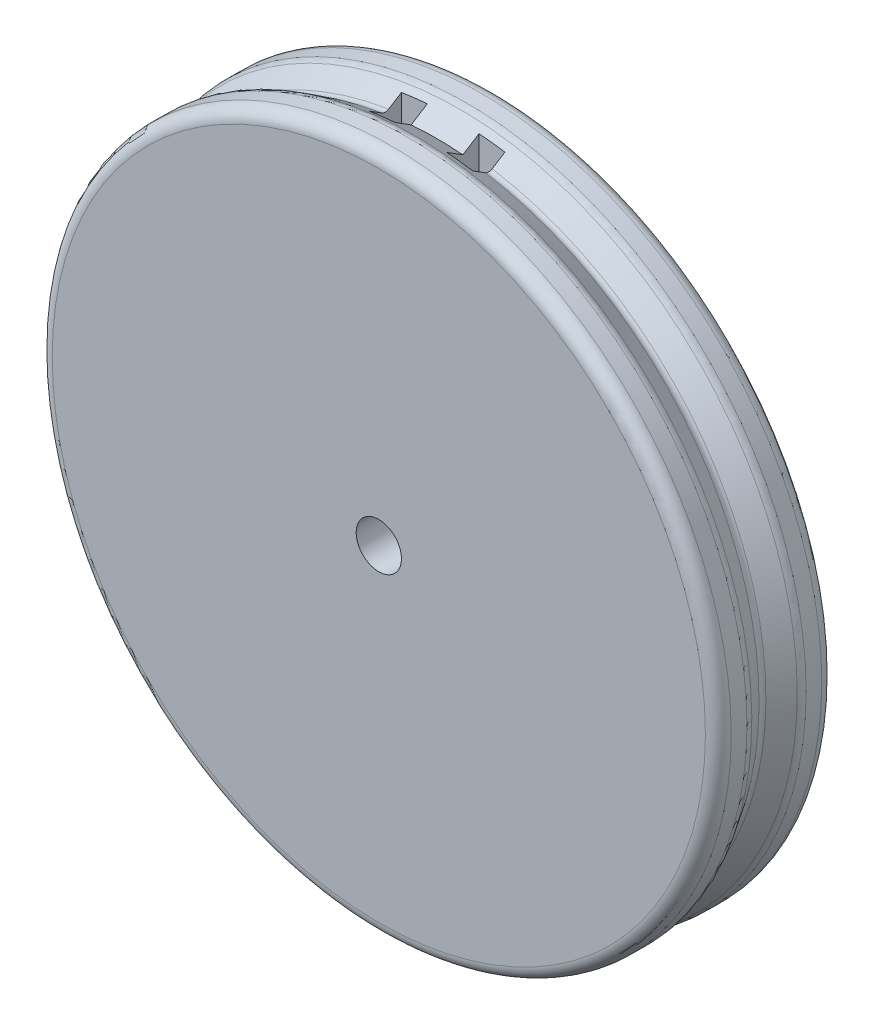
ISO-10303-21;
HEADER;
FILE_DESCRIPTION(('STEP AP214'),'2;1');
FILE_NAME('part.step','',(''),(''),'','','');
FILE_SCHEMA(('AUTOMOTIVE_DESIGN { 1 0 10303 214 1 1 1 1 }'));
ENDSEC;
DATA;
#1=APPLICATION_CONTEXT('core data for automotive mechanical design processes');
#2=APPLICATION_PROTOCOL_DEFINITION('international standard','automotive_design',2000,#1);
#3=PRODUCT_CONTEXT('',#1,'mechanical');
#4=PRODUCT('Part','Part','',(#3));
#5=PRODUCT_RELATED_PRODUCT_CATEGORY('part','',(#4));
#6=PRODUCT_DEFINITION_FORMATION('','',#4);
#7=PRODUCT_DEFINITION_CONTEXT('part definition',#1,'design');
#8=PRODUCT_DEFINITION('design','',#6,#7);
#9=PRODUCT_DEFINITION_SHAPE('','',#8);
#10=(LENGTH_UNIT() NAMED_UNIT(*) SI_UNIT(.MILLI.,.METRE.));
#11=(NAMED_UNIT(*) PLANE_ANGLE_UNIT() SI_UNIT($,.RADIAN.));
#12=(NAMED_UNIT(*) SI_UNIT($,.STERADIAN.) SOLID_ANGLE_UNIT());
#13=UNCERTAINTY_MEASURE_WITH_UNIT(LENGTH_MEASURE(1.E-05),#10,'distance_accuracy_value','');
#14=(GEOMETRIC_REPRESENTATION_CONTEXT(3) GLOBAL_UNCERTAINTY_ASSIGNED_CONTEXT((#13)) GLOBAL_UNIT_ASSIGNED_CONTEXT((#10,
#11,#12)) REPRESENTATION_CONTEXT('',''));
#15=CARTESIAN_POINT('',(0.,0.,0.));
#16=DIRECTION('',(0.,0.,1.));
#17=DIRECTION('',(1.,0.,0.));
#18=AXIS2_PLACEMENT_3D('',#15,#16,#17);
#19=CARTESIAN_POINT('',(0.,0.,0.));
#20=DIRECTION('',(0.,0.,1.));
#21=DIRECTION('',(1.,0.,0.));
#22=AXIS2_PLACEMENT_3D('',#19,#20,#21);
#23=CONICAL_SURFACE('',#22,50.,0.558599315343562);
#24=CARTESIAN_POINT('',(0.,0.,3.51359457281628));
#25=DIRECTION('',(0.,0.,-1.));
#26=DIRECTION('',(-1.,0.,0.));
#27=AXIS2_PLACEMENT_3D('',#24,#25,#26);
#28=CIRCLE('',#27,52.1959966080102);
#29=CARTESIAN_POINT('',(-52.1959966080102,0.,3.51359457281628));
#30=VERTEX_POINT('',#29);
#31=EDGE_CURVE('E11',#30,#30,#28,.T.);
#32=ORIENTED_EDGE('',*,*,#31,.T.);
#33=EDGE_LOOP('',(#32));
#34=FACE_BOUND('',#33,.T.);
#35=CARTESIAN_POINT('',(-8.,60.1595952411245,17.1026923566715));
#36=CARTESIAN_POINT('',(-8.,58.491642326766,14.4573399795328));
#37=CARTESIAN_POINT('',(-8.,56.822899257308,11.8124851117805));
#38=CARTESIAN_POINT('',(-8.,53.4831627116018,6.52420182006173));
#39=CARTESIAN_POINT('',(-8.,51.8121692384593,3.88077339413381));
#40=CARTESIAN_POINT('',(-8.,48.4672559644862,-1.40423482709844));
#41=CARTESIAN_POINT('',(-8.,46.7933361615057,-4.04581462104272));
#42=CARTESIAN_POINT('',(-8.,44.2794379450728,-8.00627094005387));
#43=CARTESIAN_POINT('',(-8.,43.4409682079165,-9.32610506125495));
#44=CARTESIAN_POINT('',(-8.,41.7628219409935,-11.9650062881157));
#45=CARTESIAN_POINT('',(-8.,40.9231454109283,-13.2840733935856));
#46=CARTESIAN_POINT('',(-8.,40.0827651894536,-14.6026923566715));
#47=B_SPLINE_CURVE_WITH_KNOTS('',3,(#35,#36,#37,#38,#39,#40,#41,#42,#43,#44,#45,#46),
.UNSPECIFIED.,.F.,.F.,(4,2,2,2,2,4),(0.,9.3818771268979,18.7637413199553,28.1456124080422,
32.8365544267009,37.5274976061084),.UNSPECIFIED.);
#48=CARTESIAN_POINT('',(-8.,50.938113493238,2.5));
#49=VERTEX_POINT('',#48);
#50=CARTESIAN_POINT('',(-8.,49.691394223485,0.529998940003178));
#51=VERTEX_POINT('',#50);
#52=EDGE_CURVE('E209',#49,#51,#47,.T.);
#53=ORIENTED_EDGE('',*,*,#52,.T.);
#54=CARTESIAN_POINT('',(0.,0.,0.529998940003176));
#55=DIRECTION('',(0.,0.,1.));
#56=DIRECTION('',(1.,0.,0.));
#57=AXIS2_PLACEMENT_3D('',#54,#55,#56);
#58=CIRCLE('',#57,50.331249337502);
#59=CARTESIAN_POINT('',(8.,49.691394223485,0.529998940003174));
#60=VERTEX_POINT('',#59);
#61=EDGE_CURVE('E312',#51,#60,#58,.T.);
#62=ORIENTED_EDGE('',*,*,#61,.T.);
#63=CARTESIAN_POINT('',(8.,40.0827651894536,-14.6026923566715));
#64=CARTESIAN_POINT('',(8.,40.9231454109283,-13.2840733935856));
#65=CARTESIAN_POINT('',(8.,41.7628219409935,-11.9650062881158));
#66=CARTESIAN_POINT('',(8.,43.4409682079165,-9.32610506125496));
#67=CARTESIAN_POINT('',(8.,44.2794379450728,-8.00627094005388));
#68=CARTESIAN_POINT('',(8.,46.7933361615057,-4.04581462104273));
#69=CARTESIAN_POINT('',(8.,48.4672559644862,-1.40423482709844));
#70=CARTESIAN_POINT('',(8.,51.8121692384593,3.88077339413381));
#71=CARTESIAN_POINT('',(8.,53.4831627116018,6.52420182006173));
#72=CARTESIAN_POINT('',(8.,56.822899257308,11.8124851117805));
#73=CARTESIAN_POINT('',(8.,58.491642326766,14.4573399795328));
#74=CARTESIAN_POINT('',(8.,60.1595952411245,17.1026923566715));
#75=B_SPLINE_CURVE_WITH_KNOTS('',3,(#63,#64,#65,#66,#67,#68,#69,#70,#71,#72,#73,#74),
.UNSPECIFIED.,.F.,.F.,(4,2,2,2,2,4),(0.,4.69094317940753,9.38188519806622,18.7637562861532,
28.1456204792105,37.5274976061084),.UNSPECIFIED.);
#76=CARTESIAN_POINT('',(8.,50.938113493238,2.5));
#77=VERTEX_POINT('',#76);
#78=EDGE_CURVE('E279',#60,#77,#75,.T.);
#79=ORIENTED_EDGE('',*,*,#78,.T.);
#80=CARTESIAN_POINT('',(0.,0.,2.5));
#81=DIRECTION('',(0.,0.,1.));
#82=DIRECTION('',(1.,0.,0.));
#83=AXIS2_PLACEMENT_3D('',#80,#81,#82);
#84=CIRCLE('',#83,51.5625);
#85=CARTESIAN_POINT('',(4.,51.4071143544354,2.5));
#86=VERTEX_POINT('',#85);
#87=EDGE_CURVE('E378',#77,#86,#84,.T.);
#88=ORIENTED_EDGE('',*,*,#87,.T.);
#89=CARTESIAN_POINT('',(4.,60.8415281505054,17.5566008124678));
#90=CARTESIAN_POINT('',(4.,59.1387265663707,14.8380054496506));
#91=CARTESIAN_POINT('',(4.,57.4357202998213,12.1195382530214));
#92=CARTESIAN_POINT('',(4.,54.0291283739475,6.68296724970331));
#93=CARTESIAN_POINT('',(4.,52.3255427146736,3.96486344298277));
#94=CARTESIAN_POINT('',(4.,48.9176215973735,-1.47087432650707));
#95=CARTESIAN_POINT('',(4.,47.2132861393114,-4.18850828925401));
#96=CARTESIAN_POINT('',(4.,43.8035476254644,-9.62310669636246));
#97=CARTESIAN_POINT('',(4.,42.0981445695848,-12.3400711406646));
#98=CARTESIAN_POINT('',(4.,40.3920489257282,-15.0566008124678));
#99=B_SPLINE_CURVE_WITH_KNOTS('',3,(#89,#90,#91,#92,#93,#94,#95,#96,#97,#98),.UNSPECIFIED.,.F.,
.F.,(4,2,2,2,4),(0.,9.62354646001774,19.247092080848,28.87063815981,38.4941850912957),.UNSPECIFIED.);
#100=CARTESIAN_POINT('',(4.,49.8397431775085,0.));
#101=VERTEX_POINT('',#100);
#102=EDGE_CURVE('E286',#86,#101,#99,.T.);
#103=ORIENTED_EDGE('',*,*,#102,.T.);
#104=CARTESIAN_POINT('',(0.,0.,0.));
#105=DIRECTION('',(0.,0.,1.));
#106=DIRECTION('',(1.,0.,0.));
#107=AXIS2_PLACEMENT_3D('',#104,#105,#106);
#108=CIRCLE('',#107,50.);
#109=CARTESIAN_POINT('',(-4.,49.8397431775085,0.));
#110=VERTEX_POINT('',#109);
#111=EDGE_CURVE('E293',#101,#110,#108,.T.);
#112=ORIENTED_EDGE('',*,*,#111,.T.);
#113=CARTESIAN_POINT('',(-4.,40.3920489257282,-15.0566008124678));
#114=CARTESIAN_POINT('',(-4.,42.0981445695848,-12.3400711406646));
#115=CARTESIAN_POINT('',(-4.,43.8035476254644,-9.62310669636246));
#116=CARTESIAN_POINT('',(-4.,47.2132861393115,-4.18850828925401));
#117=CARTESIAN_POINT('',(-4.,48.9176215973735,-1.47087432650707));
#118=CARTESIAN_POINT('',(-4.,52.3255427146736,3.96486344298278));
#119=CARTESIAN_POINT('',(-4.,54.0291283739475,6.68296724970331));
#120=CARTESIAN_POINT('',(-4.,57.4357202998213,12.1195382530214));
#121=CARTESIAN_POINT('',(-4.,59.1387265663707,14.8380054496506));
#122=CARTESIAN_POINT('',(-4.,60.8415281505054,17.5566008124678));
#123=B_SPLINE_CURVE_WITH_KNOTS('',3,(#113,#114,#115,#116,#117,#118,#119,#120,#121,#122),
.UNSPECIFIED.,.F.,.F.,(4,2,2,2,4),(0.,9.62354693148574,19.2470930104477,28.870638631278,
38.4941850912957),.UNSPECIFIED.);
#124=CARTESIAN_POINT('',(-4.,51.4071143544354,2.5));
#125=VERTEX_POINT('',#124);
#126=EDGE_CURVE('E193',#110,#125,#123,.T.);
#127=ORIENTED_EDGE('',*,*,#126,.T.);
#128=EDGE_CURVE('E363',#125,#49,#84,.T.);
#129=ORIENTED_EDGE('',*,*,#128,.T.);
#130=EDGE_LOOP('',(#53,#62,#79,#88,#103,#112,#127,#129));
#131=FACE_BOUND('',#130,.T.);
#132=ADVANCED_FACE('F39',(#34,#131),#23,.T.);
#133=CARTESIAN_POINT('',(0.,0.,9.));
#134=DIRECTION('',(0.,0.,1.));
#135=DIRECTION('',(1.,0.,0.));
#136=AXIS2_PLACEMENT_3D('',#133,#134,#135);
#137=PLANE('',#136);
#138=CARTESIAN_POINT('',(0.,0.,9.));
#139=DIRECTION('',(0.,0.,1.));
#140=DIRECTION('',(1.,0.,0.));
#141=AXIS2_PLACEMENT_3D('',#138,#139,#140);
#142=CIRCLE('',#141,50.5);
#143=CARTESIAN_POINT('',(50.5,0.,9.));
#144=VERTEX_POINT('',#143);
#145=EDGE_CURVE('E314',#144,#144,#142,.T.);
#146=ORIENTED_EDGE('',*,*,#145,.T.);
#147=EDGE_LOOP('',(#146));
#148=FACE_BOUND('',#147,.T.);
#149=CARTESIAN_POINT('',(0.,0.,9.));
#150=DIRECTION('',(0.,0.,-1.));
#151=DIRECTION('',(-1.,0.,0.));
#152=AXIS2_PLACEMENT_3D('',#149,#150,#151);
#153=CIRCLE('',#152,3.5);
#154=CARTESIAN_POINT('',(-3.5,0.,9.));
#155=VERTEX_POINT('',#154);
#156=EDGE_CURVE('E177',#155,#155,#153,.T.);
#157=ORIENTED_EDGE('',*,*,#156,.T.);
#158=EDGE_LOOP('',(#157));
#159=FACE_BOUND('',#158,.T.);
#160=ADVANCED_FACE('F355',(#148,#159),#137,.T.);
#161=CARTESIAN_POINT('',(0.,0.,9.));
#162=DIRECTION('',(0.,0.,-1.));
#163=DIRECTION('',(-1.,0.,0.));
#164=AXIS2_PLACEMENT_3D('',#161,#162,#163);
#165=CYLINDRICAL_SURFACE('',#164,52.5);
#166=CARTESIAN_POINT('',(0.,0.,7.));
#167=DIRECTION('',(0.,0.,1.));
#168=DIRECTION('',(1.,0.,0.));
#169=AXIS2_PLACEMENT_3D('',#166,#167,#168);
#170=CIRCLE('',#169,52.5);
#171=CARTESIAN_POINT('',(52.5,0.,7.));
#172=VERTEX_POINT('',#171);
#173=EDGE_CURVE('E431',#172,#172,#170,.F.);
#174=ORIENTED_EDGE('',*,*,#173,.T.);
#175=EDGE_LOOP('',(#174));
#176=FACE_BOUND('',#175,.T.);
#177=CARTESIAN_POINT('',(0.,0.,4.57359245282263));
#178=DIRECTION('',(0.,0.,-1.));
#179=DIRECTION('',(-1.,0.,0.));
#180=AXIS2_PLACEMENT_3D('',#177,#178,#179);
#181=CIRCLE('',#180,52.5);
#182=CARTESIAN_POINT('',(-52.5,0.,4.57359245282263));
#183=VERTEX_POINT('',#182);
#184=EDGE_CURVE('E319',#183,#183,#181,.F.);
#185=ORIENTED_EDGE('',*,*,#184,.T.);
#186=EDGE_LOOP('',(#185));
#187=FACE_BOUND('',#186,.T.);
#188=ADVANCED_FACE('F248',(#176,#187),#165,.T.);
#189=CARTESIAN_POINT('',(0.,0.,0.));
#190=DIRECTION('',(0.,0.,-1.));
#191=DIRECTION('',(1.,0.,0.));
#192=AXIS2_PLACEMENT_3D('',#189,#190,#191);
#193=CONICAL_SURFACE('',#192,50.,0.558599315343562);
#194=CARTESIAN_POINT('',(0.,0.,-3.51359457281627));
#195=DIRECTION('',(0.,0.,-1.));
#196=DIRECTION('',(-1.,0.,0.));
#197=AXIS2_PLACEMENT_3D('',#194,#195,#196);
#198=CIRCLE('',#197,52.1959966080102);
#199=CARTESIAN_POINT('',(-52.1959966080102,0.,-3.51359457281627));
#200=VERTEX_POINT('',#199);
#201=EDGE_CURVE('E48',#200,#200,#198,.F.);
#202=ORIENTED_EDGE('',*,*,#201,.T.);
#203=EDGE_LOOP('',(#202));
#204=FACE_BOUND('',#203,.T.);
#205=CARTESIAN_POINT('',(8.,60.1595952411245,-17.1026923566715));
#206=CARTESIAN_POINT('',(8.,58.491642326766,-14.4573399795328));
#207=CARTESIAN_POINT('',(8.,56.822899257308,-11.8124851117805));
#208=CARTESIAN_POINT('',(8.,53.4831627116018,-6.52420182006173));
#209=CARTESIAN_POINT('',(8.,51.8121692384593,-3.88077339413381));
#210=CARTESIAN_POINT('',(8.,48.4672559644862,1.40423482709844));
#211=CARTESIAN_POINT('',(8.,46.7933361615057,4.04581462104273));
#212=CARTESIAN_POINT('',(8.,44.2794379450728,8.00627094005387));
#213=CARTESIAN_POINT('',(8.,43.4409682079165,9.32610506125495));
#214=CARTESIAN_POINT('',(8.,41.7628219409935,11.9650062881158));
#215=CARTESIAN_POINT('',(8.,40.9231454109283,13.2840733935856));
#216=CARTESIAN_POINT('',(8.,40.0827651894536,14.6026923566715));
#217=B_SPLINE_CURVE_WITH_KNOTS('',3,(#205,#206,#207,#208,#209,#210,#211,#212,#213,#214,#215,
#216),.UNSPECIFIED.,.F.,.F.,(4,2,2,2,2,4),(0.,9.3818771268979,18.7637413199553,28.1456124080422,
32.8365544267009,37.5274976061084),.UNSPECIFIED.);
#218=CARTESIAN_POINT('',(8.,50.938113493238,-2.5));
#219=VERTEX_POINT('',#218);
#220=CARTESIAN_POINT('',(8.,49.691394223485,-0.529998940003178));
#221=VERTEX_POINT('',#220);
#222=EDGE_CURVE('E254',#219,#221,#217,.T.);
#223=ORIENTED_EDGE('',*,*,#222,.T.);
#224=CARTESIAN_POINT('',(0.,0.,-0.529998940003176));
#225=DIRECTION('',(0.,0.,-1.));
#226=DIRECTION('',(-1.,0.,0.));
#227=AXIS2_PLACEMENT_3D('',#224,#225,#226);
#228=CIRCLE('',#227,50.331249337502);
#229=CARTESIAN_POINT('',(-8.,49.691394223485,-0.529998940003179));
#230=VERTEX_POINT('',#229);
#231=EDGE_CURVE('E55',#221,#230,#228,.T.);
#232=ORIENTED_EDGE('',*,*,#231,.T.);
#233=CARTESIAN_POINT('',(-8.,40.0827651894536,14.6026923566715));
#234=CARTESIAN_POINT('',(-8.,40.9231454109283,13.2840733935856));
#235=CARTESIAN_POINT('',(-8.,41.7628219409935,11.9650062881157));
#236=CARTESIAN_POINT('',(-8.,43.4409682079165,9.32610506125495));
#237=CARTESIAN_POINT('',(-8.,44.2794379450728,8.00627094005388));
#238=CARTESIAN_POINT('',(-8.,46.7933361615057,4.04581462104273));
#239=CARTESIAN_POINT('',(-8.,48.4672559644862,1.40423482709844));
#240=CARTESIAN_POINT('',(-8.,51.8121692384593,-3.88077339413381));
#241=CARTESIAN_POINT('',(-8.,53.4831627116018,-6.52420182006173));
#242=CARTESIAN_POINT('',(-8.,56.822899257308,-11.8124851117805));
#243=CARTESIAN_POINT('',(-8.,58.491642326766,-14.4573399795328));
#244=CARTESIAN_POINT('',(-8.,60.1595952411245,-17.1026923566715));
#245=B_SPLINE_CURVE_WITH_KNOTS('',3,(#233,#234,#235,#236,#237,#238,#239,#240,#241,#242,#243,
#244),.UNSPECIFIED.,.F.,.F.,(4,2,2,2,2,4),(0.,4.69094317940753,9.38188519806622,
18.7637562861532,28.1456204792105,37.5274976061084),.UNSPECIFIED.);
#246=CARTESIAN_POINT('',(-8.,50.938113493238,-2.5));
#247=VERTEX_POINT('',#246);
#248=EDGE_CURVE('E235',#230,#247,#245,.T.);
#249=ORIENTED_EDGE('',*,*,#248,.T.);
#250=CARTESIAN_POINT('',(0.,0.,-2.5));
#251=DIRECTION('',(0.,0.,1.));
#252=DIRECTION('',(1.,0.,0.));
#253=AXIS2_PLACEMENT_3D('',#250,#251,#252);
#254=CIRCLE('',#253,51.5625);
#255=CARTESIAN_POINT('',(-4.,51.4071143544354,-2.5));
#256=VERTEX_POINT('',#255);
#257=EDGE_CURVE('E236',#256,#247,#254,.T.);
#258=ORIENTED_EDGE('',*,*,#257,.F.);
#259=CARTESIAN_POINT('',(-4.,60.8415281505054,-17.5566008124678));
#260=CARTESIAN_POINT('',(-4.,59.1387265663707,-14.8380054496506));
#261=CARTESIAN_POINT('',(-4.,57.4357202998213,-12.1195382530214));
#262=CARTESIAN_POINT('',(-4.,54.0291283739475,-6.68296724970331));
#263=CARTESIAN_POINT('',(-4.,52.3255427146736,-3.96486344298277));
#264=CARTESIAN_POINT('',(-4.,48.9176215973735,1.47087432650707));
#265=CARTESIAN_POINT('',(-4.,47.2132861393114,4.18850828925401));
#266=CARTESIAN_POINT('',(-4.,43.8035476254644,9.62310669636246));
#267=CARTESIAN_POINT('',(-4.,42.0981445695848,12.3400711406646));
#268=CARTESIAN_POINT('',(-4.,40.3920489257282,15.0566008124678));
#269=B_SPLINE_CURVE_WITH_KNOTS('',3,(#259,#260,#261,#262,#263,#264,#265,#266,#267,#268),
.UNSPECIFIED.,.F.,.F.,(4,2,2,2,4),(0.,9.62354646001774,19.247092080848,28.87063815981,
38.4941850912957),.UNSPECIFIED.);
#270=EDGE_CURVE('E143',#256,#110,#269,.T.);
#271=ORIENTED_EDGE('',*,*,#270,.T.);
#272=ORIENTED_EDGE('',*,*,#111,.F.);
#273=CARTESIAN_POINT('',(4.,40.3920489257282,15.0566008124678));
#274=CARTESIAN_POINT('',(4.,42.0981445695848,12.3400711406646));
#275=CARTESIAN_POINT('',(4.,43.8035476254644,9.62310669636246));
#276=CARTESIAN_POINT('',(4.,47.2132861393115,4.18850828925401));
#277=CARTESIAN_POINT('',(4.,48.9176215973735,1.47087432650707));
#278=CARTESIAN_POINT('',(4.,52.3255427146736,-3.96486344298278));
#279=CARTESIAN_POINT('',(4.,54.0291283739475,-6.68296724970331));
#280=CARTESIAN_POINT('',(4.,57.4357202998213,-12.1195382530214));
#281=CARTESIAN_POINT('',(4.,59.1387265663707,-14.8380054496506));
#282=CARTESIAN_POINT('',(4.,60.8415281505054,-17.5566008124678));
#283=B_SPLINE_CURVE_WITH_KNOTS('',3,(#273,#274,#275,#276,#277,#278,#279,#280,#281,#282),
.UNSPECIFIED.,.F.,.F.,(4,2,2,2,4),(0.,9.62354693148574,19.2470930104477,28.870638631278,
38.4941850912957),.UNSPECIFIED.);
#284=CARTESIAN_POINT('',(4.,51.4071143544354,-2.5));
#285=VERTEX_POINT('',#284);
#286=EDGE_CURVE('E261',#101,#285,#283,.T.);
#287=ORIENTED_EDGE('',*,*,#286,.T.);
#288=EDGE_CURVE('E262',#219,#285,#254,.T.);
#289=ORIENTED_EDGE('',*,*,#288,.F.);
#290=EDGE_LOOP('',(#223,#232,#249,#258,#271,#272,#287,#289));
#291=FACE_BOUND('',#290,.T.);
#292=ADVANCED_FACE('F243',(#204,#291),#193,.T.);
#293=CARTESIAN_POINT('',(0.,0.,-9.));
#294=DIRECTION('',(0.,0.,-1.));
#295=DIRECTION('',(1.,0.,0.));
#296=AXIS2_PLACEMENT_3D('',#293,#294,#295);
#297=PLANE('',#296);
#298=CARTESIAN_POINT('',(0.,0.,-9.));
#299=DIRECTION('',(0.,0.,-1.));
#300=DIRECTION('',(-1.,0.,0.));
#301=AXIS2_PLACEMENT_3D('',#298,#299,#300);
#302=CIRCLE('',#301,50.5);
#303=CARTESIAN_POINT('',(-50.5,0.,-9.));
#304=VERTEX_POINT('',#303);
#305=EDGE_CURVE('E417',#304,#304,#302,.T.);
#306=ORIENTED_EDGE('',*,*,#305,.T.);
#307=EDGE_LOOP('',(#306));
#308=FACE_BOUND('',#307,.T.);
#309=CARTESIAN_POINT('',(0.,0.,-9.));
#310=DIRECTION('',(0.,0.,-1.));
#311=DIRECTION('',(-1.,0.,0.));
#312=AXIS2_PLACEMENT_3D('',#309,#310,#311);
#313=CIRCLE('',#312,3.5);
#314=CARTESIAN_POINT('',(-3.5,0.,-9.));
#315=VERTEX_POINT('',#314);
#316=EDGE_CURVE('E160',#315,#315,#313,.T.);
#317=ORIENTED_EDGE('',*,*,#316,.F.);
#318=EDGE_LOOP('',(#317));
#319=FACE_BOUND('',#318,.T.);
#320=ADVANCED_FACE('F247',(#308,#319),#297,.T.);
#321=CARTESIAN_POINT('',(0.,0.,-9.));
#322=DIRECTION('',(0.,0.,1.));
#323=DIRECTION('',(1.,0.,0.));
#324=AXIS2_PLACEMENT_3D('',#321,#322,#323);
#325=CYLINDRICAL_SURFACE('',#324,52.5);
#326=CARTESIAN_POINT('',(0.,0.,-7.));
#327=DIRECTION('',(0.,0.,-1.));
#328=DIRECTION('',(-1.,0.,0.));
#329=AXIS2_PLACEMENT_3D('',#326,#327,#328);
#330=CIRCLE('',#329,52.5);
#331=CARTESIAN_POINT('',(-52.5,0.,-7.));
#332=VERTEX_POINT('',#331);
#333=EDGE_CURVE('E419',#332,#332,#330,.F.);
#334=ORIENTED_EDGE('',*,*,#333,.T.);
#335=EDGE_LOOP('',(#334));
#336=FACE_BOUND('',#335,.T.);
#337=CARTESIAN_POINT('',(0.,0.,-4.57359245282263));
#338=DIRECTION('',(0.,0.,-1.));
#339=DIRECTION('',(-1.,0.,0.));
#340=AXIS2_PLACEMENT_3D('',#337,#338,#339);
#341=CIRCLE('',#340,52.5);
#342=CARTESIAN_POINT('',(-52.5,0.,-4.57359245282263));
#343=VERTEX_POINT('',#342);
#344=EDGE_CURVE('E425',#343,#343,#341,.T.);
#345=ORIENTED_EDGE('',*,*,#344,.T.);
#346=EDGE_LOOP('',(#345));
#347=FACE_BOUND('',#346,.T.);
#348=ADVANCED_FACE('F389',(#336,#347),#325,.T.);
#349=CARTESIAN_POINT('',(0.,37.5,2.5));
#350=DIRECTION('',(0.,0.,1.));
#351=DIRECTION('',(1.,0.,0.));
#352=AXIS2_PLACEMENT_3D('',#349,#350,#351);
#353=PLANE('',#352);
#354=DIRECTION('',(0.,1.,0.));
#355=VECTOR('',#354,1.);
#356=CARTESIAN_POINT('',(8.,37.5,2.5));
#357=LINE('',#356,#355);
#358=CARTESIAN_POINT('',(8.,37.5,2.5));
#359=VERTEX_POINT('',#358);
#360=EDGE_CURVE('E157',#359,#77,#357,.T.);
#361=ORIENTED_EDGE('',*,*,#360,.F.);
#362=CARTESIAN_POINT('',(0.,37.5,2.5));
#363=DIRECTION('',(0.,0.,1.));
#364=DIRECTION('',(1.,0.,0.));
#365=AXIS2_PLACEMENT_3D('',#362,#363,#364);
#366=CIRCLE('',#365,8.);
#367=CARTESIAN_POINT('',(-8.,37.5,2.5));
#368=VERTEX_POINT('',#367);
#369=EDGE_CURVE('E183',#368,#359,#366,.T.);
#370=ORIENTED_EDGE('',*,*,#369,.F.);
#371=DIRECTION('',(0.,-1.,0.));
#372=VECTOR('',#371,1.);
#373=CARTESIAN_POINT('',(-8.,37.5,2.5));
#374=LINE('',#373,#372);
#375=EDGE_CURVE('E180',#49,#368,#374,.T.);
#376=ORIENTED_EDGE('',*,*,#375,.F.);
#377=ORIENTED_EDGE('',*,*,#128,.F.);
#378=DIRECTION('',(0.,1.,0.));
#379=VECTOR('',#378,1.);
#380=CARTESIAN_POINT('',(-4.,37.5,2.5));
#381=LINE('',#380,#379);
#382=CARTESIAN_POINT('',(-4.,37.5,2.5));
#383=VERTEX_POINT('',#382);
#384=EDGE_CURVE('E176',#383,#125,#381,.T.);
#385=ORIENTED_EDGE('',*,*,#384,.F.);
#386=CARTESIAN_POINT('',(0.,37.5,2.5));
#387=DIRECTION('',(0.,0.,-1.));
#388=DIRECTION('',(1.,0.,0.));
#389=AXIS2_PLACEMENT_3D('',#386,#387,#388);
#390=CIRCLE('',#389,4.);
#391=CARTESIAN_POINT('',(4.,37.5,2.5));
#392=VERTEX_POINT('',#391);
#393=EDGE_CURVE('E131',#392,#383,#390,.T.);
#394=ORIENTED_EDGE('',*,*,#393,.F.);
#395=DIRECTION('',(0.,-1.,0.));
#396=VECTOR('',#395,1.);
#397=CARTESIAN_POINT('',(4.,37.5,2.5));
#398=LINE('',#397,#396);
#399=EDGE_CURVE('E154',#86,#392,#398,.T.);
#400=ORIENTED_EDGE('',*,*,#399,.F.);
#401=ORIENTED_EDGE('',*,*,#87,.F.);
#402=EDGE_LOOP('',(#361,#370,#376,#377,#385,#394,#400,#401));
#403=FACE_BOUND('',#402,.T.);
#404=ADVANCED_FACE('F369',(#403),#353,.F.);
#405=CARTESIAN_POINT('',(4.,37.5,-2.5));
#406=DIRECTION('',(-1.,0.,0.));
#407=DIRECTION('',(0.,-1.,0.));
#408=AXIS2_PLACEMENT_3D('',#405,#406,#407);
#409=PLANE('',#408);
#410=ORIENTED_EDGE('',*,*,#399,.T.);
#411=DIRECTION('',(0.,0.,1.));
#412=VECTOR('',#411,1.);
#413=CARTESIAN_POINT('',(4.,37.5,-2.5));
#414=LINE('',#413,#412);
#415=CARTESIAN_POINT('',(4.,37.5,-2.5));
#416=VERTEX_POINT('',#415);
#417=EDGE_CURVE('E190',#416,#392,#414,.T.);
#418=ORIENTED_EDGE('',*,*,#417,.F.);
#419=DIRECTION('',(0.,-1.,0.));
#420=VECTOR('',#419,1.);
#421=CARTESIAN_POINT('',(4.,37.5,-2.5));
#422=LINE('',#421,#420);
#423=EDGE_CURVE('E137',#285,#416,#422,.T.);
#424=ORIENTED_EDGE('',*,*,#423,.F.);
#425=ORIENTED_EDGE('',*,*,#286,.F.);
#426=ORIENTED_EDGE('',*,*,#102,.F.);
#427=EDGE_LOOP('',(#410,#418,#424,#425,#426));
#428=FACE_BOUND('',#427,.T.);
#429=ADVANCED_FACE('F272',(#428),#409,.F.);
#430=CARTESIAN_POINT('',(8.,37.5,-2.5));
#431=DIRECTION('',(1.,0.,0.));
#432=DIRECTION('',(0.,1.,0.));
#433=AXIS2_PLACEMENT_3D('',#430,#431,#432);
#434=PLANE('',#433);
#435=ORIENTED_EDGE('',*,*,#222,.F.);
#436=DIRECTION('',(0.,1.,0.));
#437=VECTOR('',#436,1.);
#438=CARTESIAN_POINT('',(8.,37.5,-2.5));
#439=LINE('',#438,#437);
#440=CARTESIAN_POINT('',(8.,37.5,-2.5));
#441=VERTEX_POINT('',#440);
#442=EDGE_CURVE('E169',#441,#219,#439,.T.);
#443=ORIENTED_EDGE('',*,*,#442,.F.);
#444=DIRECTION('',(0.,0.,1.));
#445=VECTOR('',#444,1.);
#446=CARTESIAN_POINT('',(8.,37.5,-2.5));
#447=LINE('',#446,#445);
#448=EDGE_CURVE('E194',#441,#359,#447,.T.);
#449=ORIENTED_EDGE('',*,*,#448,.T.);
#450=ORIENTED_EDGE('',*,*,#360,.T.);
#451=ORIENTED_EDGE('',*,*,#78,.F.);
#452=CARTESIAN_POINT('',(8.00000000000001,49.691394223485,0.529998940003178));
#453=CARTESIAN_POINT('',(8.,49.676477259883,0.506434939469642));
#454=CARTESIAN_POINT('',(8.,49.6625551028698,0.482256411508557));
#455=CARTESIAN_POINT('',(8.,49.6367870008401,0.432817459071064));
#456=CARTESIAN_POINT('',(8.,49.6249410486714,0.407557038321994));
#457=CARTESIAN_POINT('',(8.,49.5926822899076,0.330457163363877));
#458=CARTESIAN_POINT('',(8.,49.5754994763402,0.277221436360927));
#459=CARTESIAN_POINT('',(8.,49.5503356533953,0.168611931470871));
#460=CARTESIAN_POINT('',(8.,49.5423601111991,0.113236903434387));
#461=CARTESIAN_POINT('',(8.,49.5358594647868,0.00192196679715718));
#462=CARTESIAN_POINT('',(8.,49.5373348458205,-0.0540179706611654));
#463=CARTESIAN_POINT('',(8.,49.5496686967589,-0.164649277174181));
#464=CARTESIAN_POINT('',(8.,49.5604954201349,-0.219344228684216));
#465=CARTESIAN_POINT('',(8.,49.5911626053104,-0.326113134498612));
#466=CARTESIAN_POINT('',(8.,49.6109923473862,-0.378190124285654));
#467=CARTESIAN_POINT('',(8.,49.6433936649633,-0.445710885768893));
#468=CARTESIAN_POINT('',(8.,49.652312680029,-0.462976629510708));
#469=CARTESIAN_POINT('',(8.,49.6711268512976,-0.496925387187456));
#470=CARTESIAN_POINT('',(8.,49.6810201377832,-0.513609437193717));
#471=CARTESIAN_POINT('',(8.,49.691394223485,-0.529998940003181));
#472=B_SPLINE_CURVE_WITH_KNOTS('',3,(#452,#453,#454,#455,#456,#457,#458,#459,#460,#461,#462,
#463,#464,#465,#466,#467,#468,#469,#470,#471),.UNSPECIFIED.,.F.,.F.,(4,2,2,2,2,2,2,2,2,4),(0.,
0.0836156277286378,0.167230967407884,0.334189488919128,0.501247097741981,0.668313284069151,
0.83481452286713,1.00111802961841,1.05939340528897,1.11755904729481),.UNSPECIFIED.);
#473=EDGE_CURVE('E63',#60,#221,#472,.T.);
#474=ORIENTED_EDGE('',*,*,#473,.T.);
#475=EDGE_LOOP('',(#435,#443,#449,#450,#451,#474));
#476=FACE_BOUND('',#475,.T.);
#477=ADVANCED_FACE('F269',(#476),#434,.F.);
#478=CARTESIAN_POINT('',(-8.,37.5,-2.5));
#479=DIRECTION('',(-1.,0.,0.));
#480=DIRECTION('',(0.,-1.,0.));
#481=AXIS2_PLACEMENT_3D('',#478,#479,#480);
#482=PLANE('',#481);
#483=ORIENTED_EDGE('',*,*,#375,.T.);
#484=DIRECTION('',(0.,0.,1.));
#485=VECTOR('',#484,1.);
#486=CARTESIAN_POINT('',(-8.,37.5,-2.5));
#487=LINE('',#486,#485);
#488=CARTESIAN_POINT('',(-8.,37.5,-2.5));
#489=VERTEX_POINT('',#488);
#490=EDGE_CURVE('E136',#489,#368,#487,.T.);
#491=ORIENTED_EDGE('',*,*,#490,.F.);
#492=DIRECTION('',(0.,-1.,0.));
#493=VECTOR('',#492,1.);
#494=CARTESIAN_POINT('',(-8.,37.5,-2.5));
#495=LINE('',#494,#493);
#496=EDGE_CURVE('E148',#247,#489,#495,.T.);
#497=ORIENTED_EDGE('',*,*,#496,.F.);
#498=ORIENTED_EDGE('',*,*,#248,.F.);
#499=CARTESIAN_POINT('',(-8.00000000000001,49.691394223485,-0.529998940003178));
#500=CARTESIAN_POINT('',(-8.,49.676477259883,-0.50643493946964));
#501=CARTESIAN_POINT('',(-8.,49.6625551028698,-0.482256411508554));
#502=CARTESIAN_POINT('',(-8.,49.6367870008401,-0.43281745907106));
#503=CARTESIAN_POINT('',(-8.,49.6249410486714,-0.407557038321991));
#504=CARTESIAN_POINT('',(-8.,49.5926822899076,-0.330457163363875));
#505=CARTESIAN_POINT('',(-8.,49.5754994763402,-0.277221436360926));
#506=CARTESIAN_POINT('',(-8.,49.5503356533953,-0.168611931470871));
#507=CARTESIAN_POINT('',(-8.,49.5423601111991,-0.113236903434387));
#508=CARTESIAN_POINT('',(-8.,49.5358594647868,-0.00192196679715763));
#509=CARTESIAN_POINT('',(-8.,49.5373348458205,0.054017970661165));
#510=CARTESIAN_POINT('',(-8.,49.5496686967589,0.164649277174181));
#511=CARTESIAN_POINT('',(-8.,49.5604954201349,0.219344228684216));
#512=CARTESIAN_POINT('',(-8.,49.5911626053104,0.326113134498611));
#513=CARTESIAN_POINT('',(-8.,49.6109923473862,0.378190124285654));
#514=CARTESIAN_POINT('',(-8.,49.6433936649633,0.445710885768893));
#515=CARTESIAN_POINT('',(-8.,49.652312680029,0.462976629510708));
#516=CARTESIAN_POINT('',(-8.,49.6711268512976,0.496925387187456));
#517=CARTESIAN_POINT('',(-8.,49.6810201377832,0.513609437193717));
#518=CARTESIAN_POINT('',(-8.,49.691394223485,0.529998940003181));
#519=B_SPLINE_CURVE_WITH_KNOTS('',3,(#499,#500,#501,#502,#503,#504,#505,#506,#507,#508,#509,
#510,#511,#512,#513,#514,#515,#516,#517,#518),.UNSPECIFIED.,.F.,.F.,(4,2,2,2,2,2,2,2,2,4),(0.,
0.0836156277286412,0.167230967407886,0.334189488919127,0.501247097741981,0.668313284069151,
0.83481452286713,1.00111802961841,1.05939340528897,1.11755904729481),.UNSPECIFIED.);
#520=EDGE_CURVE('E305',#230,#51,#519,.T.);
#521=ORIENTED_EDGE('',*,*,#520,.T.);
#522=ORIENTED_EDGE('',*,*,#52,.F.);
#523=EDGE_LOOP('',(#483,#491,#497,#498,#521,#522));
#524=FACE_BOUND('',#523,.T.);
#525=ADVANCED_FACE('F222',(#524),#482,.F.);
#526=CARTESIAN_POINT('',(-4.,37.5,-2.5));
#527=DIRECTION('',(1.,0.,0.));
#528=DIRECTION('',(0.,1.,0.));
#529=AXIS2_PLACEMENT_3D('',#526,#527,#528);
#530=PLANE('',#529);
#531=ORIENTED_EDGE('',*,*,#270,.F.);
#532=DIRECTION('',(0.,1.,0.));
#533=VECTOR('',#532,1.);
#534=CARTESIAN_POINT('',(-4.,37.5,-2.5));
#535=LINE('',#534,#533);
#536=CARTESIAN_POINT('',(-4.,37.5,-2.5));
#537=VERTEX_POINT('',#536);
#538=EDGE_CURVE('E140',#537,#256,#535,.T.);
#539=ORIENTED_EDGE('',*,*,#538,.F.);
#540=DIRECTION('',(0.,0.,1.));
#541=VECTOR('',#540,1.);
#542=CARTESIAN_POINT('',(-4.,37.5,-2.5));
#543=LINE('',#542,#541);
#544=EDGE_CURVE('E124',#537,#383,#543,.T.);
#545=ORIENTED_EDGE('',*,*,#544,.T.);
#546=ORIENTED_EDGE('',*,*,#384,.T.);
#547=ORIENTED_EDGE('',*,*,#126,.F.);
#548=EDGE_LOOP('',(#531,#539,#545,#546,#547));
#549=FACE_BOUND('',#548,.T.);
#550=ADVANCED_FACE('F141',(#549),#530,.F.);
#551=CARTESIAN_POINT('',(0.,37.5,-2.5));
#552=DIRECTION('',(0.,0.,1.));
#553=DIRECTION('',(1.,0.,0.));
#554=AXIS2_PLACEMENT_3D('',#551,#552,#553);
#555=PLANE('',#554);
#556=ORIENTED_EDGE('',*,*,#288,.T.);
#557=ORIENTED_EDGE('',*,*,#423,.T.);
#558=CARTESIAN_POINT('',(0.,37.5,-2.5));
#559=DIRECTION('',(0.,0.,-1.));
#560=DIRECTION('',(1.,0.,0.));
#561=AXIS2_PLACEMENT_3D('',#558,#559,#560);
#562=CIRCLE('',#561,4.);
#563=EDGE_CURVE('E129',#416,#537,#562,.T.);
#564=ORIENTED_EDGE('',*,*,#563,.T.);
#565=ORIENTED_EDGE('',*,*,#538,.T.);
#566=ORIENTED_EDGE('',*,*,#257,.T.);
#567=ORIENTED_EDGE('',*,*,#496,.T.);
#568=CARTESIAN_POINT('',(0.,37.5,-2.5));
#569=DIRECTION('',(0.,0.,1.));
#570=DIRECTION('',(1.,0.,0.));
#571=AXIS2_PLACEMENT_3D('',#568,#569,#570);
#572=CIRCLE('',#571,8.);
#573=EDGE_CURVE('E165',#489,#441,#572,.T.);
#574=ORIENTED_EDGE('',*,*,#573,.T.);
#575=ORIENTED_EDGE('',*,*,#442,.T.);
#576=EDGE_LOOP('',(#556,#557,#564,#565,#566,#567,#574,#575));
#577=FACE_BOUND('',#576,.T.);
#578=ADVANCED_FACE('F150',(#577),#555,.T.);
#579=CARTESIAN_POINT('',(0.,37.5,-2.5));
#580=DIRECTION('',(0.,0.,1.));
#581=DIRECTION('',(1.,0.,0.));
#582=AXIS2_PLACEMENT_3D('',#579,#580,#581);
#583=CYLINDRICAL_SURFACE('',#582,4.);
#584=ORIENTED_EDGE('',*,*,#393,.T.);
#585=ORIENTED_EDGE('',*,*,#544,.F.);
#586=ORIENTED_EDGE('',*,*,#563,.F.);
#587=ORIENTED_EDGE('',*,*,#417,.T.);
#588=EDGE_LOOP('',(#584,#585,#586,#587));
#589=FACE_BOUND('',#588,.T.);
#590=ADVANCED_FACE('F126',(#589),#583,.T.);
#591=CARTESIAN_POINT('',(0.,37.5,-2.5));
#592=DIRECTION('',(0.,0.,1.));
#593=DIRECTION('',(1.,0.,0.));
#594=AXIS2_PLACEMENT_3D('',#591,#592,#593);
#595=CYLINDRICAL_SURFACE('',#594,8.);
#596=ORIENTED_EDGE('',*,*,#369,.T.);
#597=ORIENTED_EDGE('',*,*,#448,.F.);
#598=ORIENTED_EDGE('',*,*,#573,.F.);
#599=ORIENTED_EDGE('',*,*,#490,.T.);
#600=EDGE_LOOP('',(#596,#597,#598,#599));
#601=FACE_BOUND('',#600,.T.);
#602=ADVANCED_FACE('F275',(#601),#595,.F.);
#603=CARTESIAN_POINT('',(0.,0.,9.));
#604=DIRECTION('',(0.,0.,-1.));
#605=DIRECTION('',(-1.,0.,0.));
#606=AXIS2_PLACEMENT_3D('',#603,#604,#605);
#607=CYLINDRICAL_SURFACE('',#606,3.5);
#608=ORIENTED_EDGE('',*,*,#156,.F.);
#609=EDGE_LOOP('',(#608));
#610=FACE_BOUND('',#609,.T.);
#611=ORIENTED_EDGE('',*,*,#316,.T.);
#612=EDGE_LOOP('',(#611));
#613=FACE_BOUND('',#612,.T.);
#614=ADVANCED_FACE('F337',(#610,#613),#607,.F.);
#615=CARTESIAN_POINT('',(0.,0.,0.));
#616=DIRECTION('',(0.,0.,1.));
#617=DIRECTION('',(1.,0.,0.));
#618=AXIS2_PLACEMENT_3D('',#615,#616,#617);
#619=TOROIDAL_SURFACE('',#618,51.1792476415071,1.);
#620=ORIENTED_EDGE('',*,*,#520,.F.);
#621=ORIENTED_EDGE('',*,*,#231,.F.);
#622=ORIENTED_EDGE('',*,*,#473,.F.);
#623=ORIENTED_EDGE('',*,*,#61,.F.);
#624=EDGE_LOOP('',(#620,#621,#622,#623));
#625=FACE_BOUND('',#624,.T.);
#626=ADVANCED_FACE('F310',(#625),#619,.F.);
#627=CARTESIAN_POINT('',(0.,0.,7.));
#628=DIRECTION('',(0.,0.,1.));
#629=DIRECTION('',(1.,0.,0.));
#630=AXIS2_PLACEMENT_3D('',#627,#628,#629);
#631=TOROIDAL_SURFACE('',#630,50.5,2.);
#632=ORIENTED_EDGE('',*,*,#173,.F.);
#633=EDGE_LOOP('',(#632));
#634=FACE_BOUND('',#633,.T.);
#635=ORIENTED_EDGE('',*,*,#145,.F.);
#636=EDGE_LOOP('',(#635));
#637=FACE_BOUND('',#636,.T.);
#638=ADVANCED_FACE('F336',(#634,#637),#631,.T.);
#639=CARTESIAN_POINT('',(0.,0.,-7.));
#640=DIRECTION('',(0.,0.,-1.));
#641=DIRECTION('',(-1.,0.,0.));
#642=AXIS2_PLACEMENT_3D('',#639,#640,#641);
#643=TOROIDAL_SURFACE('',#642,50.5,2.);
#644=ORIENTED_EDGE('',*,*,#305,.F.);
#645=EDGE_LOOP('',(#644));
#646=FACE_BOUND('',#645,.T.);
#647=ORIENTED_EDGE('',*,*,#333,.F.);
#648=EDGE_LOOP('',(#647));
#649=FACE_BOUND('',#648,.T.);
#650=ADVANCED_FACE('F341',(#646,#649),#643,.T.);
#651=CARTESIAN_POINT('',(0.,0.,-4.57359245282263));
#652=DIRECTION('',(0.,0.,-1.));
#653=DIRECTION('',(-1.,0.,0.));
#654=AXIS2_PLACEMENT_3D('',#651,#652,#653);
#655=TOROIDAL_SURFACE('',#654,50.5,2.);
#656=ORIENTED_EDGE('',*,*,#344,.F.);
#657=EDGE_LOOP('',(#656));
#658=FACE_BOUND('',#657,.T.);
#659=ORIENTED_EDGE('',*,*,#201,.F.);
#660=EDGE_LOOP('',(#659));
#661=FACE_BOUND('',#660,.T.);
#662=ADVANCED_FACE('F344',(#658,#661),#655,.T.);
#663=CARTESIAN_POINT('',(0.,0.,4.57359245282263));
#664=DIRECTION('',(0.,0.,-1.));
#665=DIRECTION('',(-1.,0.,0.));
#666=AXIS2_PLACEMENT_3D('',#663,#664,#665);
#667=TOROIDAL_SURFACE('',#666,50.5,2.);
#668=ORIENTED_EDGE('',*,*,#31,.F.);
#669=EDGE_LOOP('',(#668));
#670=FACE_BOUND('',#669,.T.);
#671=ORIENTED_EDGE('',*,*,#184,.F.);
#672=EDGE_LOOP('',(#671));
#673=FACE_BOUND('',#672,.T.);
#674=ADVANCED_FACE('F41',(#670,#673),#667,.T.);
#675=CLOSED_SHELL('',(#132,#160,#188,#292,#320,#348,#404,#429,#477,#525,#550,#578,#590,#602,
#614,#626,#638,#650,#662,#674));
#676=MANIFOLD_SOLID_BREP('B2',#675);
#677=ADVANCED_BREP_SHAPE_REPRESENTATION('',(#18,#676),#14);
#678=SHAPE_DEFINITION_REPRESENTATION(#9,#677);
ENDSEC;
END-ISO-10303-21;
